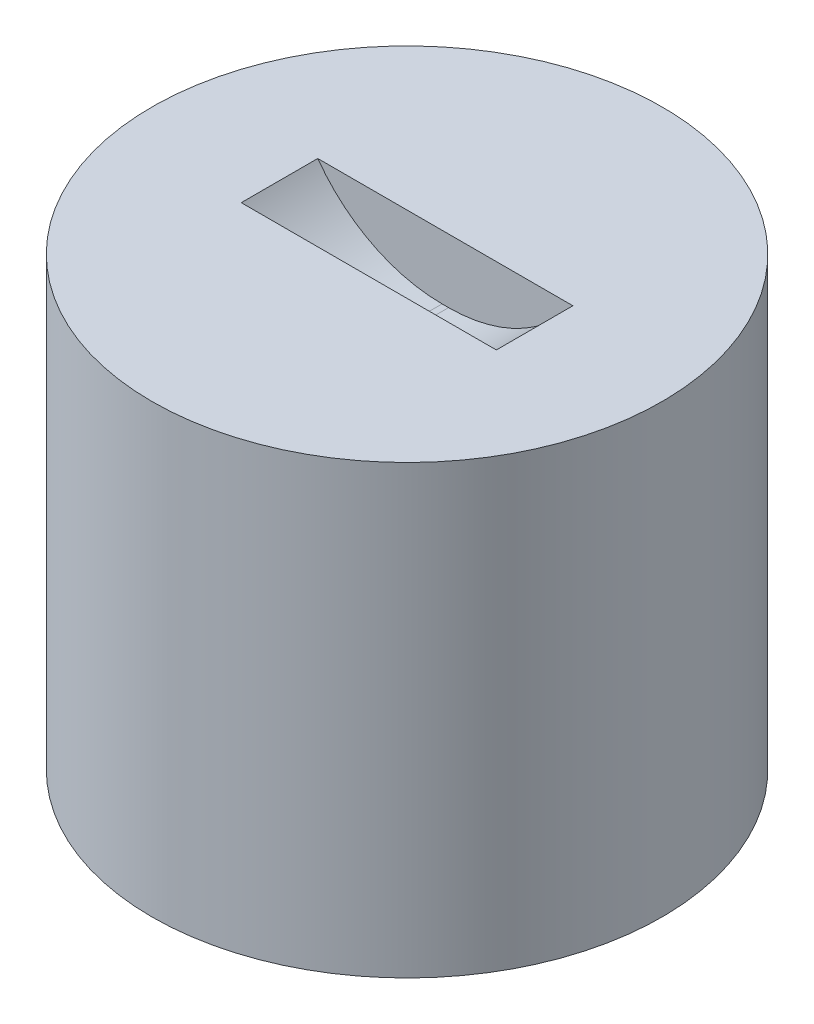
ISO-10303-21;
HEADER;
FILE_DESCRIPTION(('STEP AP214'),'2;1');
FILE_NAME('part.step','',(''),(''),'','','');
FILE_SCHEMA(('AUTOMOTIVE_DESIGN { 1 0 10303 214 1 1 1 1 }'));
ENDSEC;
DATA;
#1=APPLICATION_CONTEXT('core data for automotive mechanical design processes');
#2=APPLICATION_PROTOCOL_DEFINITION('international standard','automotive_design',2000,#1);
#3=PRODUCT_CONTEXT('',#1,'mechanical');
#4=PRODUCT('Part','Part','',(#3));
#5=PRODUCT_RELATED_PRODUCT_CATEGORY('part','',(#4));
#6=PRODUCT_DEFINITION_FORMATION('','',#4);
#7=PRODUCT_DEFINITION_CONTEXT('part definition',#1,'design');
#8=PRODUCT_DEFINITION('design','',#6,#7);
#9=PRODUCT_DEFINITION_SHAPE('','',#8);
#10=(LENGTH_UNIT() NAMED_UNIT(*) SI_UNIT(.MILLI.,.METRE.));
#11=(NAMED_UNIT(*) PLANE_ANGLE_UNIT() SI_UNIT($,.RADIAN.));
#12=(NAMED_UNIT(*) SI_UNIT($,.STERADIAN.) SOLID_ANGLE_UNIT());
#13=UNCERTAINTY_MEASURE_WITH_UNIT(LENGTH_MEASURE(1.E-05),#10,'distance_accuracy_value','');
#14=(GEOMETRIC_REPRESENTATION_CONTEXT(3) GLOBAL_UNCERTAINTY_ASSIGNED_CONTEXT((#13)) GLOBAL_UNIT_ASSIGNED_CONTEXT((#10,
#11,#12)) REPRESENTATION_CONTEXT('',''));
#15=CARTESIAN_POINT('',(0.,0.,0.));
#16=DIRECTION('',(0.,0.,1.));
#17=DIRECTION('',(1.,0.,0.));
#18=AXIS2_PLACEMENT_3D('',#15,#16,#17);
#19=CARTESIAN_POINT('',(0.,35.,0.));
#20=DIRECTION('',(0.,-1.,0.));
#21=DIRECTION('',(0.,0.,-1.));
#22=AXIS2_PLACEMENT_3D('',#19,#20,#21);
#23=CYLINDRICAL_SURFACE('',#22,20.);
#24=CARTESIAN_POINT('',(0.,35.,0.));
#25=DIRECTION('',(0.,1.,0.));
#26=DIRECTION('',(0.,0.,1.));
#27=AXIS2_PLACEMENT_3D('',#24,#25,#26);
#28=CIRCLE('',#27,20.);
#29=CARTESIAN_POINT('',(0.,35.,20.));
#30=VERTEX_POINT('',#29);
#31=EDGE_CURVE('E106',#30,#30,#28,.T.);
#32=ORIENTED_EDGE('',*,*,#31,.F.);
#33=EDGE_LOOP('',(#32));
#34=FACE_BOUND('',#33,.T.);
#35=CARTESIAN_POINT('',(0.,0.,0.));
#36=DIRECTION('',(0.,1.,0.));
#37=DIRECTION('',(0.,0.,1.));
#38=AXIS2_PLACEMENT_3D('',#35,#36,#37);
#39=CIRCLE('',#38,20.);
#40=CARTESIAN_POINT('',(0.,0.,20.));
#41=VERTEX_POINT('',#40);
#42=EDGE_CURVE('E102',#41,#41,#39,.T.);
#43=ORIENTED_EDGE('',*,*,#42,.T.);
#44=EDGE_LOOP('',(#43));
#45=FACE_BOUND('',#44,.T.);
#46=ADVANCED_FACE('F33',(#34,#45),#23,.T.);
#47=CARTESIAN_POINT('',(0.,35.,0.));
#48=DIRECTION('',(0.,1.,0.));
#49=DIRECTION('',(0.,0.,1.));
#50=AXIS2_PLACEMENT_3D('',#47,#48,#49);
#51=PLANE('',#50);
#52=DIRECTION('',(0.,0.,1.));
#53=VECTOR('',#52,1.);
#54=CARTESIAN_POINT('',(-10.,35.,-3.));
#55=LINE('',#54,#53);
#56=CARTESIAN_POINT('',(-10.,35.,-3.));
#57=VERTEX_POINT('',#56);
#58=CARTESIAN_POINT('',(-10.,35.,3.));
#59=VERTEX_POINT('',#58);
#60=EDGE_CURVE('E84',#57,#59,#55,.T.);
#61=ORIENTED_EDGE('',*,*,#60,.F.);
#62=DIRECTION('',(-1.,0.,0.));
#63=VECTOR('',#62,1.);
#64=CARTESIAN_POINT('',(10.,35.,-3.));
#65=LINE('',#64,#63);
#66=CARTESIAN_POINT('',(10.,35.,-3.));
#67=VERTEX_POINT('',#66);
#68=EDGE_CURVE('E89',#67,#57,#65,.T.);
#69=ORIENTED_EDGE('',*,*,#68,.F.);
#70=DIRECTION('',(0.,0.,-1.));
#71=VECTOR('',#70,1.);
#72=CARTESIAN_POINT('',(10.,35.,-3.));
#73=LINE('',#72,#71);
#74=CARTESIAN_POINT('',(10.,35.,3.));
#75=VERTEX_POINT('',#74);
#76=EDGE_CURVE('E83',#75,#67,#73,.T.);
#77=ORIENTED_EDGE('',*,*,#76,.F.);
#78=DIRECTION('',(1.,0.,0.));
#79=VECTOR('',#78,1.);
#80=CARTESIAN_POINT('',(10.,35.,3.));
#81=LINE('',#80,#79);
#82=EDGE_CURVE('E72',#59,#75,#81,.T.);
#83=ORIENTED_EDGE('',*,*,#82,.F.);
#84=EDGE_LOOP('',(#61,#69,#77,#83));
#85=FACE_BOUND('',#84,.T.);
#86=ORIENTED_EDGE('',*,*,#31,.T.);
#87=EDGE_LOOP('',(#86));
#88=FACE_BOUND('',#87,.T.);
#89=ADVANCED_FACE('F87',(#85,#88),#51,.T.);
#90=CARTESIAN_POINT('',(0.,0.,0.));
#91=DIRECTION('',(0.,1.,0.));
#92=DIRECTION('',(0.,0.,1.));
#93=AXIS2_PLACEMENT_3D('',#90,#91,#92);
#94=PLANE('',#93);
#95=ORIENTED_EDGE('',*,*,#42,.F.);
#96=EDGE_LOOP('',(#95));
#97=FACE_BOUND('',#96,.T.);
#98=ADVANCED_FACE('F128',(#97),#94,.F.);
#99=CARTESIAN_POINT('',(10.,30.,-3.));
#100=DIRECTION('',(0.,0.,-1.));
#101=DIRECTION('',(-1.,0.,0.));
#102=AXIS2_PLACEMENT_3D('',#99,#100,#101);
#103=PLANE('',#102);
#104=ORIENTED_EDGE('',*,*,#68,.T.);
#105=CARTESIAN_POINT('',(-0.253205655191036,42.,-3.));
#106=DIRECTION('',(0.,0.,-1.));
#107=DIRECTION('',(-1.,0.,0.));
#108=AXIS2_PLACEMENT_3D('',#105,#106,#107);
#109=CIRCLE('',#108,12.);
#110=CARTESIAN_POINT('',(-0.253205655191036,30.,-3.));
#111=VERTEX_POINT('',#110);
#112=EDGE_CURVE('E11',#57,#111,#109,.F.);
#113=ORIENTED_EDGE('',*,*,#112,.T.);
#114=DIRECTION('',(-1.,0.,0.));
#115=VECTOR('',#114,1.);
#116=CARTESIAN_POINT('',(10.,30.,-3.));
#117=LINE('',#116,#115);
#118=CARTESIAN_POINT('',(0.253205655191036,30.,-3.));
#119=VERTEX_POINT('',#118);
#120=EDGE_CURVE('E99',#119,#111,#117,.T.);
#121=ORIENTED_EDGE('',*,*,#120,.F.);
#122=CARTESIAN_POINT('',(0.253205655191036,42.,-3.));
#123=DIRECTION('',(0.,0.,-1.));
#124=DIRECTION('',(-1.,0.,0.));
#125=AXIS2_PLACEMENT_3D('',#122,#123,#124);
#126=CIRCLE('',#125,12.);
#127=EDGE_CURVE('E41',#119,#67,#126,.F.);
#128=ORIENTED_EDGE('',*,*,#127,.T.);
#129=EDGE_LOOP('',(#104,#113,#121,#128));
#130=FACE_BOUND('',#129,.T.);
#131=ADVANCED_FACE('F98',(#130),#103,.F.);
#132=CARTESIAN_POINT('',(10.,30.,3.));
#133=DIRECTION('',(0.,0.,1.));
#134=DIRECTION('',(1.,0.,0.));
#135=AXIS2_PLACEMENT_3D('',#132,#133,#134);
#136=PLANE('',#135);
#137=DIRECTION('',(1.,0.,0.));
#138=VECTOR('',#137,1.);
#139=CARTESIAN_POINT('',(10.,30.,3.));
#140=LINE('',#139,#138);
#141=CARTESIAN_POINT('',(-0.253205655191036,30.,3.));
#142=VERTEX_POINT('',#141);
#143=CARTESIAN_POINT('',(0.253205655191036,30.,3.));
#144=VERTEX_POINT('',#143);
#145=EDGE_CURVE('E103',#142,#144,#140,.T.);
#146=ORIENTED_EDGE('',*,*,#145,.F.);
#147=CARTESIAN_POINT('',(-0.253205655191036,42.,3.));
#148=DIRECTION('',(0.,0.,1.));
#149=DIRECTION('',(1.,0.,0.));
#150=AXIS2_PLACEMENT_3D('',#147,#148,#149);
#151=CIRCLE('',#150,12.);
#152=EDGE_CURVE('E79',#142,#59,#151,.F.);
#153=ORIENTED_EDGE('',*,*,#152,.T.);
#154=ORIENTED_EDGE('',*,*,#82,.T.);
#155=CARTESIAN_POINT('',(0.253205655191036,42.,3.));
#156=DIRECTION('',(0.,0.,1.));
#157=DIRECTION('',(1.,0.,0.));
#158=AXIS2_PLACEMENT_3D('',#155,#156,#157);
#159=CIRCLE('',#158,12.);
#160=EDGE_CURVE('E77',#75,#144,#159,.F.);
#161=ORIENTED_EDGE('',*,*,#160,.T.);
#162=EDGE_LOOP('',(#146,#153,#154,#161));
#163=FACE_BOUND('',#162,.T.);
#164=ADVANCED_FACE('F75',(#163),#136,.F.);
#165=CARTESIAN_POINT('',(0.,30.,0.));
#166=DIRECTION('',(0.,-1.,0.));
#167=DIRECTION('',(0.,0.,-1.));
#168=AXIS2_PLACEMENT_3D('',#165,#166,#167);
#169=PLANE('',#168);
#170=ORIENTED_EDGE('',*,*,#120,.T.);
#171=DIRECTION('',(0.,0.,-1.));
#172=VECTOR('',#171,1.);
#173=CARTESIAN_POINT('',(-0.253205655191036,30.,0.));
#174=LINE('',#173,#172);
#175=EDGE_CURVE('E92',#111,#142,#174,.F.);
#176=ORIENTED_EDGE('',*,*,#175,.T.);
#177=ORIENTED_EDGE('',*,*,#145,.T.);
#178=DIRECTION('',(0.,0.,1.));
#179=VECTOR('',#178,1.);
#180=CARTESIAN_POINT('',(0.253205655191036,30.,0.));
#181=LINE('',#180,#179);
#182=EDGE_CURVE('E91',#144,#119,#181,.F.);
#183=ORIENTED_EDGE('',*,*,#182,.T.);
#184=EDGE_LOOP('',(#170,#176,#177,#183));
#185=FACE_BOUND('',#184,.T.);
#186=ADVANCED_FACE('F113',(#185),#169,.F.);
#187=CARTESIAN_POINT('',(-0.253205655191036,42.,-3.));
#188=DIRECTION('',(0.,0.,-1.));
#189=DIRECTION('',(-1.,0.,0.));
#190=AXIS2_PLACEMENT_3D('',#187,#188,#189);
#191=CYLINDRICAL_SURFACE('',#190,12.);
#192=ORIENTED_EDGE('',*,*,#112,.F.);
#193=ORIENTED_EDGE('',*,*,#60,.T.);
#194=ORIENTED_EDGE('',*,*,#152,.F.);
#195=ORIENTED_EDGE('',*,*,#175,.F.);
#196=EDGE_LOOP('',(#192,#193,#194,#195));
#197=FACE_BOUND('',#196,.T.);
#198=ADVANCED_FACE('F115',(#197),#191,.F.);
#199=CARTESIAN_POINT('',(0.253205655191036,42.,-3.));
#200=DIRECTION('',(0.,0.,1.));
#201=DIRECTION('',(1.,0.,0.));
#202=AXIS2_PLACEMENT_3D('',#199,#200,#201);
#203=CYLINDRICAL_SURFACE('',#202,12.);
#204=ORIENTED_EDGE('',*,*,#160,.F.);
#205=ORIENTED_EDGE('',*,*,#76,.T.);
#206=ORIENTED_EDGE('',*,*,#127,.F.);
#207=ORIENTED_EDGE('',*,*,#182,.F.);
#208=EDGE_LOOP('',(#204,#205,#206,#207));
#209=FACE_BOUND('',#208,.T.);
#210=ADVANCED_FACE('F35',(#209),#203,.F.);
#211=CLOSED_SHELL('',(#46,#89,#98,#131,#164,#186,#198,#210));
#212=MANIFOLD_SOLID_BREP('B2',#211);
#213=ADVANCED_BREP_SHAPE_REPRESENTATION('',(#18,#212),#14);
#214=SHAPE_DEFINITION_REPRESENTATION(#9,#213);
ENDSEC;
END-ISO-10303-21;
